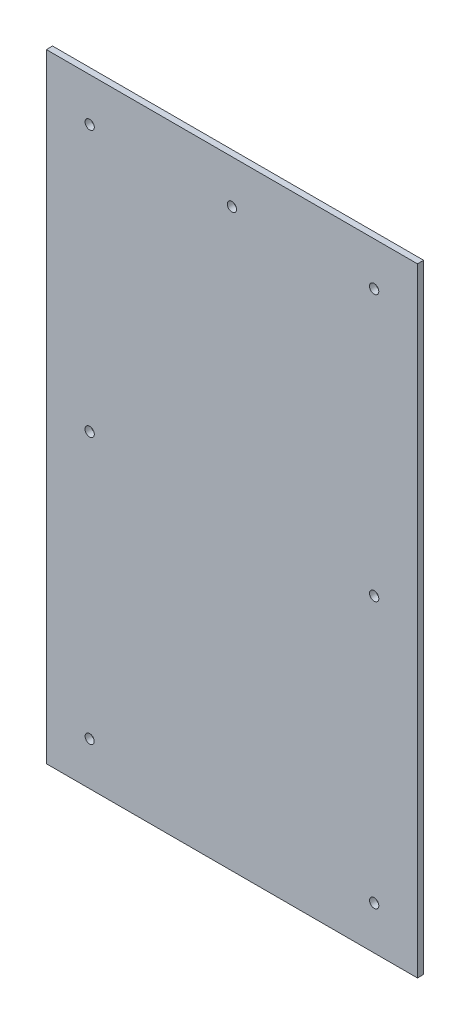
ISO-10303-21;
HEADER;
FILE_DESCRIPTION(('STEP AP214'),'2;1');
FILE_NAME('part.step','',(''),(''),'','','');
FILE_SCHEMA(('AUTOMOTIVE_DESIGN { 1 0 10303 214 1 1 1 1 }'));
ENDSEC;
DATA;
#1=APPLICATION_CONTEXT('core data for automotive mechanical design processes');
#2=APPLICATION_PROTOCOL_DEFINITION('international standard','automotive_design',2000,#1);
#3=PRODUCT_CONTEXT('',#1,'mechanical');
#4=PRODUCT('Part','Part','',(#3));
#5=PRODUCT_RELATED_PRODUCT_CATEGORY('part','',(#4));
#6=PRODUCT_DEFINITION_FORMATION('','',#4);
#7=PRODUCT_DEFINITION_CONTEXT('part definition',#1,'design');
#8=PRODUCT_DEFINITION('design','',#6,#7);
#9=PRODUCT_DEFINITION_SHAPE('','',#8);
#10=(LENGTH_UNIT() NAMED_UNIT(*) SI_UNIT(.MILLI.,.METRE.));
#11=(NAMED_UNIT(*) PLANE_ANGLE_UNIT() SI_UNIT($,.RADIAN.));
#12=(NAMED_UNIT(*) SI_UNIT($,.STERADIAN.) SOLID_ANGLE_UNIT());
#13=UNCERTAINTY_MEASURE_WITH_UNIT(LENGTH_MEASURE(1.E-05),#10,'distance_accuracy_value','');
#14=(GEOMETRIC_REPRESENTATION_CONTEXT(3) GLOBAL_UNCERTAINTY_ASSIGNED_CONTEXT((#13)) GLOBAL_UNIT_ASSIGNED_CONTEXT((#10,
#11,#12)) REPRESENTATION_CONTEXT('',''));
#15=CARTESIAN_POINT('',(0.,0.,0.));
#16=DIRECTION('',(0.,0.,1.));
#17=DIRECTION('',(1.,0.,0.));
#18=AXIS2_PLACEMENT_3D('',#15,#16,#17);
#19=CARTESIAN_POINT('',(0.,0.,6.35));
#20=DIRECTION('',(0.,0.,1.));
#21=DIRECTION('',(1.,0.,0.));
#22=AXIS2_PLACEMENT_3D('',#19,#20,#21);
#23=PLANE('',#22);
#24=CARTESIAN_POINT('',(44.45,317.5,6.35));
#25=DIRECTION('',(0.,0.,-1.));
#26=DIRECTION('',(-1.,0.,0.));
#27=AXIS2_PLACEMENT_3D('',#24,#25,#26);
#28=CIRCLE('',#27,4.7625);
#29=CARTESIAN_POINT('',(39.6875,317.5,6.35));
#30=VERTEX_POINT('',#29);
#31=EDGE_CURVE('E101',#30,#30,#28,.T.);
#32=ORIENTED_EDGE('',*,*,#31,.T.);
#33=EDGE_LOOP('',(#32));
#34=FACE_BOUND('',#33,.T.);
#35=CARTESIAN_POINT('',(336.55,317.5,6.35));
#36=DIRECTION('',(0.,0.,-1.));
#37=DIRECTION('',(-1.,0.,0.));
#38=AXIS2_PLACEMENT_3D('',#35,#36,#37);
#39=CIRCLE('',#38,4.7625);
#40=CARTESIAN_POINT('',(331.7875,317.5,6.35));
#41=VERTEX_POINT('',#40);
#42=EDGE_CURVE('E104',#41,#41,#39,.T.);
#43=ORIENTED_EDGE('',*,*,#42,.T.);
#44=EDGE_LOOP('',(#43));
#45=FACE_BOUND('',#44,.T.);
#46=CARTESIAN_POINT('',(336.55,44.45,6.35));
#47=DIRECTION('',(0.,0.,-1.));
#48=DIRECTION('',(-1.,0.,0.));
#49=AXIS2_PLACEMENT_3D('',#46,#47,#48);
#50=CIRCLE('',#49,4.7625);
#51=CARTESIAN_POINT('',(331.7875,44.45,6.35));
#52=VERTEX_POINT('',#51);
#53=EDGE_CURVE('E107',#52,#52,#50,.T.);
#54=ORIENTED_EDGE('',*,*,#53,.T.);
#55=EDGE_LOOP('',(#54));
#56=FACE_BOUND('',#55,.T.);
#57=CARTESIAN_POINT('',(44.45,44.45,6.35));
#58=DIRECTION('',(0.,0.,-1.));
#59=DIRECTION('',(-1.,0.,0.));
#60=AXIS2_PLACEMENT_3D('',#57,#58,#59);
#61=CIRCLE('',#60,4.699);
#62=CARTESIAN_POINT('',(39.751,44.45,6.35));
#63=VERTEX_POINT('',#62);
#64=EDGE_CURVE('E110',#63,#63,#61,.T.);
#65=ORIENTED_EDGE('',*,*,#64,.T.);
#66=EDGE_LOOP('',(#65));
#67=FACE_BOUND('',#66,.T.);
#68=CARTESIAN_POINT('',(336.55,590.55,6.35));
#69=DIRECTION('',(0.,0.,-1.));
#70=DIRECTION('',(-1.,0.,0.));
#71=AXIS2_PLACEMENT_3D('',#68,#69,#70);
#72=CIRCLE('',#71,4.7625);
#73=CARTESIAN_POINT('',(331.7875,590.55,6.35));
#74=VERTEX_POINT('',#73);
#75=EDGE_CURVE('E113',#74,#74,#72,.T.);
#76=ORIENTED_EDGE('',*,*,#75,.T.);
#77=EDGE_LOOP('',(#76));
#78=FACE_BOUND('',#77,.T.);
#79=CARTESIAN_POINT('',(190.5,590.55,6.35));
#80=DIRECTION('',(0.,0.,-1.));
#81=DIRECTION('',(-1.,0.,0.));
#82=AXIS2_PLACEMENT_3D('',#79,#80,#81);
#83=CIRCLE('',#82,4.7625);
#84=CARTESIAN_POINT('',(185.7375,590.55,6.35));
#85=VERTEX_POINT('',#84);
#86=EDGE_CURVE('E115',#85,#85,#83,.T.);
#87=ORIENTED_EDGE('',*,*,#86,.T.);
#88=EDGE_LOOP('',(#87));
#89=FACE_BOUND('',#88,.T.);
#90=CARTESIAN_POINT('',(44.45,590.55,6.35));
#91=DIRECTION('',(0.,0.,-1.));
#92=DIRECTION('',(-1.,0.,0.));
#93=AXIS2_PLACEMENT_3D('',#90,#91,#92);
#94=CIRCLE('',#93,4.7625);
#95=CARTESIAN_POINT('',(39.6875,590.55,6.35));
#96=VERTEX_POINT('',#95);
#97=EDGE_CURVE('E20',#96,#96,#94,.T.);
#98=ORIENTED_EDGE('',*,*,#97,.T.);
#99=EDGE_LOOP('',(#98));
#100=FACE_BOUND('',#99,.T.);
#101=DIRECTION('',(0.,1.,0.));
#102=VECTOR('',#101,1.);
#103=CARTESIAN_POINT('',(0.,635.,6.35));
#104=LINE('',#103,#102);
#105=CARTESIAN_POINT('',(0.,0.,6.35));
#106=VERTEX_POINT('',#105);
#107=CARTESIAN_POINT('',(0.,635.,6.35));
#108=VERTEX_POINT('',#107);
#109=EDGE_CURVE('E71',#106,#108,#104,.T.);
#110=ORIENTED_EDGE('',*,*,#109,.F.);
#111=DIRECTION('',(1.,0.,0.));
#112=VECTOR('',#111,1.);
#113=CARTESIAN_POINT('',(0.,0.,6.35));
#114=LINE('',#113,#112);
#115=CARTESIAN_POINT('',(381.,0.,6.35));
#116=VERTEX_POINT('',#115);
#117=EDGE_CURVE('E68',#116,#106,#114,.F.);
#118=ORIENTED_EDGE('',*,*,#117,.F.);
#119=DIRECTION('',(0.,1.,0.));
#120=VECTOR('',#119,1.);
#121=CARTESIAN_POINT('',(381.,0.,6.35));
#122=LINE('',#121,#120);
#123=CARTESIAN_POINT('',(381.,635.,6.35));
#124=VERTEX_POINT('',#123);
#125=EDGE_CURVE('E59',#124,#116,#122,.F.);
#126=ORIENTED_EDGE('',*,*,#125,.F.);
#127=DIRECTION('',(1.,0.,0.));
#128=VECTOR('',#127,1.);
#129=CARTESIAN_POINT('',(381.,635.,6.35));
#130=LINE('',#129,#128);
#131=EDGE_CURVE('E54',#108,#124,#130,.T.);
#132=ORIENTED_EDGE('',*,*,#131,.F.);
#133=EDGE_LOOP('',(#110,#118,#126,#132));
#134=FACE_BOUND('',#133,.T.);
#135=ADVANCED_FACE('F17',(#34,#45,#56,#67,#78,#89,#100,#134),#23,.T.);
#136=CARTESIAN_POINT('',(0.,0.,0.));
#137=DIRECTION('',(0.,-1.,0.));
#138=DIRECTION('',(0.,0.,-1.));
#139=AXIS2_PLACEMENT_3D('',#136,#137,#138);
#140=PLANE('',#139);
#141=DIRECTION('',(0.,0.,1.));
#142=VECTOR('',#141,1.);
#143=CARTESIAN_POINT('',(0.,0.,0.));
#144=LINE('',#143,#142);
#145=CARTESIAN_POINT('',(0.,0.,0.));
#146=VERTEX_POINT('',#145);
#147=EDGE_CURVE('E123',#146,#106,#144,.T.);
#148=ORIENTED_EDGE('',*,*,#147,.F.);
#149=DIRECTION('',(1.,0.,0.));
#150=VECTOR('',#149,1.);
#151=CARTESIAN_POINT('',(0.,0.,0.));
#152=LINE('',#151,#150);
#153=CARTESIAN_POINT('',(381.,0.,0.));
#154=VERTEX_POINT('',#153);
#155=EDGE_CURVE('E78',#146,#154,#152,.T.);
#156=ORIENTED_EDGE('',*,*,#155,.T.);
#157=DIRECTION('',(0.,0.,-1.));
#158=VECTOR('',#157,1.);
#159=CARTESIAN_POINT('',(381.,0.,0.));
#160=LINE('',#159,#158);
#161=EDGE_CURVE('E64',#116,#154,#160,.T.);
#162=ORIENTED_EDGE('',*,*,#161,.F.);
#163=ORIENTED_EDGE('',*,*,#117,.T.);
#164=EDGE_LOOP('',(#148,#156,#162,#163));
#165=FACE_BOUND('',#164,.T.);
#166=ADVANCED_FACE('F77',(#165),#140,.T.);
#167=CARTESIAN_POINT('',(381.,0.,0.));
#168=DIRECTION('',(1.,0.,0.));
#169=DIRECTION('',(0.,0.,-1.));
#170=AXIS2_PLACEMENT_3D('',#167,#168,#169);
#171=PLANE('',#170);
#172=ORIENTED_EDGE('',*,*,#161,.T.);
#173=DIRECTION('',(0.,1.,0.));
#174=VECTOR('',#173,1.);
#175=CARTESIAN_POINT('',(381.,0.,0.));
#176=LINE('',#175,#174);
#177=CARTESIAN_POINT('',(381.,635.,0.));
#178=VERTEX_POINT('',#177);
#179=EDGE_CURVE('E134',#154,#178,#176,.T.);
#180=ORIENTED_EDGE('',*,*,#179,.T.);
#181=DIRECTION('',(0.,0.,1.));
#182=VECTOR('',#181,1.);
#183=CARTESIAN_POINT('',(381.,635.,0.));
#184=LINE('',#183,#182);
#185=EDGE_CURVE('E66',#124,#178,#184,.F.);
#186=ORIENTED_EDGE('',*,*,#185,.F.);
#187=ORIENTED_EDGE('',*,*,#125,.T.);
#188=EDGE_LOOP('',(#172,#180,#186,#187));
#189=FACE_BOUND('',#188,.T.);
#190=ADVANCED_FACE('F61',(#189),#171,.T.);
#191=CARTESIAN_POINT('',(381.,635.,0.));
#192=DIRECTION('',(0.,1.,0.));
#193=DIRECTION('',(0.,0.,1.));
#194=AXIS2_PLACEMENT_3D('',#191,#192,#193);
#195=PLANE('',#194);
#196=ORIENTED_EDGE('',*,*,#185,.T.);
#197=DIRECTION('',(1.,0.,0.));
#198=VECTOR('',#197,1.);
#199=CARTESIAN_POINT('',(0.,635.,0.));
#200=LINE('',#199,#198);
#201=CARTESIAN_POINT('',(0.,635.,0.));
#202=VERTEX_POINT('',#201);
#203=EDGE_CURVE('E131',#178,#202,#200,.F.);
#204=ORIENTED_EDGE('',*,*,#203,.T.);
#205=DIRECTION('',(0.,0.,1.));
#206=VECTOR('',#205,1.);
#207=CARTESIAN_POINT('',(0.,635.,0.));
#208=LINE('',#207,#206);
#209=EDGE_CURVE('E35',#108,#202,#208,.F.);
#210=ORIENTED_EDGE('',*,*,#209,.F.);
#211=ORIENTED_EDGE('',*,*,#131,.T.);
#212=EDGE_LOOP('',(#196,#204,#210,#211));
#213=FACE_BOUND('',#212,.T.);
#214=ADVANCED_FACE('F130',(#213),#195,.T.);
#215=CARTESIAN_POINT('',(0.,635.,0.));
#216=DIRECTION('',(-1.,0.,0.));
#217=DIRECTION('',(0.,0.,1.));
#218=AXIS2_PLACEMENT_3D('',#215,#216,#217);
#219=PLANE('',#218);
#220=ORIENTED_EDGE('',*,*,#209,.T.);
#221=DIRECTION('',(0.,1.,0.));
#222=VECTOR('',#221,1.);
#223=CARTESIAN_POINT('',(0.,0.,0.));
#224=LINE('',#223,#222);
#225=EDGE_CURVE('E100',#202,#146,#224,.F.);
#226=ORIENTED_EDGE('',*,*,#225,.T.);
#227=ORIENTED_EDGE('',*,*,#147,.T.);
#228=ORIENTED_EDGE('',*,*,#109,.T.);
#229=EDGE_LOOP('',(#220,#226,#227,#228));
#230=FACE_BOUND('',#229,.T.);
#231=ADVANCED_FACE('F137',(#230),#219,.T.);
#232=CARTESIAN_POINT('',(44.45,590.55,6.35));
#233=DIRECTION('',(0.,0.,-1.));
#234=DIRECTION('',(-1.,0.,0.));
#235=AXIS2_PLACEMENT_3D('',#232,#233,#234);
#236=CYLINDRICAL_SURFACE('',#235,4.7625);
#237=ORIENTED_EDGE('',*,*,#97,.F.);
#238=EDGE_LOOP('',(#237));
#239=FACE_BOUND('',#238,.T.);
#240=CARTESIAN_POINT('',(44.45,590.55,0.));
#241=DIRECTION('',(0.,0.,-1.));
#242=DIRECTION('',(-1.,0.,0.));
#243=AXIS2_PLACEMENT_3D('',#240,#241,#242);
#244=CIRCLE('',#243,4.7625);
#245=CARTESIAN_POINT('',(39.6875,590.55,0.));
#246=VERTEX_POINT('',#245);
#247=EDGE_CURVE('E97',#246,#246,#244,.T.);
#248=ORIENTED_EDGE('',*,*,#247,.T.);
#249=EDGE_LOOP('',(#248));
#250=FACE_BOUND('',#249,.T.);
#251=ADVANCED_FACE('F139',(#239,#250),#236,.F.);
#252=CARTESIAN_POINT('',(190.5,590.55,6.35));
#253=DIRECTION('',(0.,0.,-1.));
#254=DIRECTION('',(-1.,0.,0.));
#255=AXIS2_PLACEMENT_3D('',#252,#253,#254);
#256=CYLINDRICAL_SURFACE('',#255,4.7625);
#257=CARTESIAN_POINT('',(190.5,590.55,0.));
#258=DIRECTION('',(0.,0.,-1.));
#259=DIRECTION('',(-1.,0.,0.));
#260=AXIS2_PLACEMENT_3D('',#257,#258,#259);
#261=CIRCLE('',#260,4.7625);
#262=CARTESIAN_POINT('',(185.7375,590.55,0.));
#263=VERTEX_POINT('',#262);
#264=EDGE_CURVE('E94',#263,#263,#261,.T.);
#265=ORIENTED_EDGE('',*,*,#264,.T.);
#266=EDGE_LOOP('',(#265));
#267=FACE_BOUND('',#266,.T.);
#268=ORIENTED_EDGE('',*,*,#86,.F.);
#269=EDGE_LOOP('',(#268));
#270=FACE_BOUND('',#269,.T.);
#271=ADVANCED_FACE('F146',(#267,#270),#256,.F.);
#272=CARTESIAN_POINT('',(336.55,590.55,6.35));
#273=DIRECTION('',(0.,0.,-1.));
#274=DIRECTION('',(-1.,0.,0.));
#275=AXIS2_PLACEMENT_3D('',#272,#273,#274);
#276=CYLINDRICAL_SURFACE('',#275,4.7625);
#277=ORIENTED_EDGE('',*,*,#75,.F.);
#278=EDGE_LOOP('',(#277));
#279=FACE_BOUND('',#278,.T.);
#280=CARTESIAN_POINT('',(336.55,590.55,0.));
#281=DIRECTION('',(0.,0.,-1.));
#282=DIRECTION('',(-1.,0.,0.));
#283=AXIS2_PLACEMENT_3D('',#280,#281,#282);
#284=CIRCLE('',#283,4.7625);
#285=CARTESIAN_POINT('',(331.7875,590.55,0.));
#286=VERTEX_POINT('',#285);
#287=EDGE_CURVE('E91',#286,#286,#284,.T.);
#288=ORIENTED_EDGE('',*,*,#287,.T.);
#289=EDGE_LOOP('',(#288));
#290=FACE_BOUND('',#289,.T.);
#291=ADVANCED_FACE('F173',(#279,#290),#276,.F.);
#292=CARTESIAN_POINT('',(44.45,44.45,6.35));
#293=DIRECTION('',(0.,0.,-1.));
#294=DIRECTION('',(-1.,0.,0.));
#295=AXIS2_PLACEMENT_3D('',#292,#293,#294);
#296=CYLINDRICAL_SURFACE('',#295,4.699);
#297=ORIENTED_EDGE('',*,*,#64,.F.);
#298=EDGE_LOOP('',(#297));
#299=FACE_BOUND('',#298,.T.);
#300=CARTESIAN_POINT('',(44.45,44.45,0.));
#301=DIRECTION('',(0.,0.,-1.));
#302=DIRECTION('',(-1.,0.,0.));
#303=AXIS2_PLACEMENT_3D('',#300,#301,#302);
#304=CIRCLE('',#303,4.699);
#305=CARTESIAN_POINT('',(39.751,44.45,0.));
#306=VERTEX_POINT('',#305);
#307=EDGE_CURVE('E88',#306,#306,#304,.T.);
#308=ORIENTED_EDGE('',*,*,#307,.T.);
#309=EDGE_LOOP('',(#308));
#310=FACE_BOUND('',#309,.T.);
#311=ADVANCED_FACE('F169',(#299,#310),#296,.F.);
#312=CARTESIAN_POINT('',(336.55,44.45,6.35));
#313=DIRECTION('',(0.,0.,-1.));
#314=DIRECTION('',(-1.,0.,0.));
#315=AXIS2_PLACEMENT_3D('',#312,#313,#314);
#316=CYLINDRICAL_SURFACE('',#315,4.7625);
#317=ORIENTED_EDGE('',*,*,#53,.F.);
#318=EDGE_LOOP('',(#317));
#319=FACE_BOUND('',#318,.T.);
#320=CARTESIAN_POINT('',(336.55,44.45,0.));
#321=DIRECTION('',(0.,0.,-1.));
#322=DIRECTION('',(-1.,0.,0.));
#323=AXIS2_PLACEMENT_3D('',#320,#321,#322);
#324=CIRCLE('',#323,4.7625);
#325=CARTESIAN_POINT('',(331.7875,44.45,0.));
#326=VERTEX_POINT('',#325);
#327=EDGE_CURVE('E85',#326,#326,#324,.T.);
#328=ORIENTED_EDGE('',*,*,#327,.T.);
#329=EDGE_LOOP('',(#328));
#330=FACE_BOUND('',#329,.T.);
#331=ADVANCED_FACE('F165',(#319,#330),#316,.F.);
#332=CARTESIAN_POINT('',(336.55,317.5,6.35));
#333=DIRECTION('',(0.,0.,-1.));
#334=DIRECTION('',(-1.,0.,0.));
#335=AXIS2_PLACEMENT_3D('',#332,#333,#334);
#336=CYLINDRICAL_SURFACE('',#335,4.7625);
#337=ORIENTED_EDGE('',*,*,#42,.F.);
#338=EDGE_LOOP('',(#337));
#339=FACE_BOUND('',#338,.T.);
#340=CARTESIAN_POINT('',(336.55,317.5,0.));
#341=DIRECTION('',(0.,0.,-1.));
#342=DIRECTION('',(-1.,0.,0.));
#343=AXIS2_PLACEMENT_3D('',#340,#341,#342);
#344=CIRCLE('',#343,4.7625);
#345=CARTESIAN_POINT('',(331.7875,317.5,0.));
#346=VERTEX_POINT('',#345);
#347=EDGE_CURVE('E26',#346,#346,#344,.T.);
#348=ORIENTED_EDGE('',*,*,#347,.T.);
#349=EDGE_LOOP('',(#348));
#350=FACE_BOUND('',#349,.T.);
#351=ADVANCED_FACE('F157',(#339,#350),#336,.F.);
#352=CARTESIAN_POINT('',(44.45,317.5,6.35));
#353=DIRECTION('',(0.,0.,-1.));
#354=DIRECTION('',(-1.,0.,0.));
#355=AXIS2_PLACEMENT_3D('',#352,#353,#354);
#356=CYLINDRICAL_SURFACE('',#355,4.7625);
#357=ORIENTED_EDGE('',*,*,#31,.F.);
#358=EDGE_LOOP('',(#357));
#359=FACE_BOUND('',#358,.T.);
#360=CARTESIAN_POINT('',(44.45,317.5,0.));
#361=DIRECTION('',(0.,0.,-1.));
#362=DIRECTION('',(-1.,0.,0.));
#363=AXIS2_PLACEMENT_3D('',#360,#361,#362);
#364=CIRCLE('',#363,4.7625);
#365=CARTESIAN_POINT('',(39.6875,317.5,0.));
#366=VERTEX_POINT('',#365);
#367=EDGE_CURVE('E11',#366,#366,#364,.T.);
#368=ORIENTED_EDGE('',*,*,#367,.T.);
#369=EDGE_LOOP('',(#368));
#370=FACE_BOUND('',#369,.T.);
#371=ADVANCED_FACE('F151',(#359,#370),#356,.F.);
#372=CARTESIAN_POINT('',(0.,0.,0.));
#373=DIRECTION('',(0.,0.,1.));
#374=DIRECTION('',(1.,0.,0.));
#375=AXIS2_PLACEMENT_3D('',#372,#373,#374);
#376=PLANE('',#375);
#377=ORIENTED_EDGE('',*,*,#367,.F.);
#378=EDGE_LOOP('',(#377));
#379=FACE_BOUND('',#378,.T.);
#380=ORIENTED_EDGE('',*,*,#347,.F.);
#381=EDGE_LOOP('',(#380));
#382=FACE_BOUND('',#381,.T.);
#383=ORIENTED_EDGE('',*,*,#327,.F.);
#384=EDGE_LOOP('',(#383));
#385=FACE_BOUND('',#384,.T.);
#386=ORIENTED_EDGE('',*,*,#307,.F.);
#387=EDGE_LOOP('',(#386));
#388=FACE_BOUND('',#387,.T.);
#389=ORIENTED_EDGE('',*,*,#287,.F.);
#390=EDGE_LOOP('',(#389));
#391=FACE_BOUND('',#390,.T.);
#392=ORIENTED_EDGE('',*,*,#264,.F.);
#393=EDGE_LOOP('',(#392));
#394=FACE_BOUND('',#393,.T.);
#395=ORIENTED_EDGE('',*,*,#247,.F.);
#396=EDGE_LOOP('',(#395));
#397=FACE_BOUND('',#396,.T.);
#398=ORIENTED_EDGE('',*,*,#203,.F.);
#399=ORIENTED_EDGE('',*,*,#179,.F.);
#400=ORIENTED_EDGE('',*,*,#155,.F.);
#401=ORIENTED_EDGE('',*,*,#225,.F.);
#402=EDGE_LOOP('',(#398,#399,#400,#401));
#403=FACE_BOUND('',#402,.T.);
#404=ADVANCED_FACE('F133',(#379,#382,#385,#388,#391,#394,#397,#403),#376,.F.);
#405=CLOSED_SHELL('',(#135,#166,#190,#214,#231,#251,#271,#291,#311,#331,#351,#371,#404));
#406=MANIFOLD_SOLID_BREP('B1',#405);
#407=ADVANCED_BREP_SHAPE_REPRESENTATION('',(#18,#406),#14);
#408=SHAPE_DEFINITION_REPRESENTATION(#9,#407);
ENDSEC;
END-ISO-10303-21;
